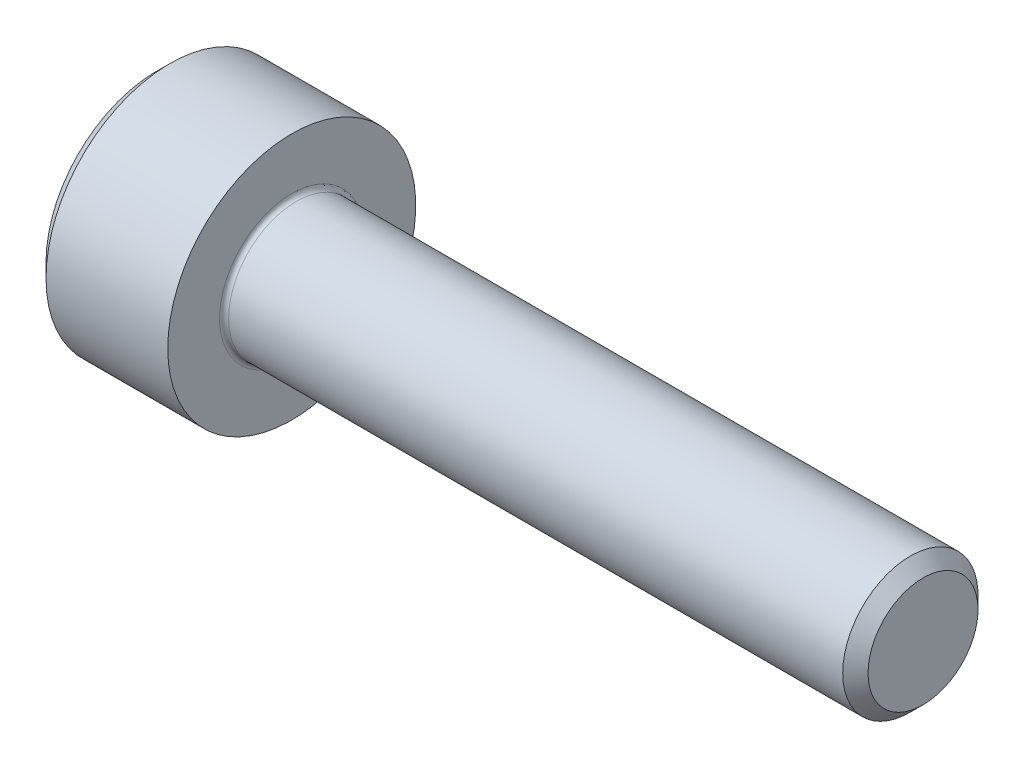
ISO-10303-21;
HEADER;
FILE_DESCRIPTION(('STEP AP214'),'2;1');
FILE_NAME('part.step','',(''),(''),'','','');
FILE_SCHEMA(('AUTOMOTIVE_DESIGN { 1 0 10303 214 1 1 1 1 }'));
ENDSEC;
DATA;
#1=APPLICATION_CONTEXT('core data for automotive mechanical design processes');
#2=APPLICATION_PROTOCOL_DEFINITION('international standard','automotive_design',2000,#1);
#3=PRODUCT_CONTEXT('',#1,'mechanical');
#4=PRODUCT('Part','Part','',(#3));
#5=PRODUCT_RELATED_PRODUCT_CATEGORY('part','',(#4));
#6=PRODUCT_DEFINITION_FORMATION('','',#4);
#7=PRODUCT_DEFINITION_CONTEXT('part definition',#1,'design');
#8=PRODUCT_DEFINITION('design','',#6,#7);
#9=PRODUCT_DEFINITION_SHAPE('','',#8);
#10=(LENGTH_UNIT() NAMED_UNIT(*) SI_UNIT(.MILLI.,.METRE.));
#11=(NAMED_UNIT(*) PLANE_ANGLE_UNIT() SI_UNIT($,.RADIAN.));
#12=(NAMED_UNIT(*) SI_UNIT($,.STERADIAN.) SOLID_ANGLE_UNIT());
#13=UNCERTAINTY_MEASURE_WITH_UNIT(LENGTH_MEASURE(1.E-05),#10,'distance_accuracy_value','');
#14=(GEOMETRIC_REPRESENTATION_CONTEXT(3) GLOBAL_UNCERTAINTY_ASSIGNED_CONTEXT((#13)) GLOBAL_UNIT_ASSIGNED_CONTEXT((#10,
#11,#12)) REPRESENTATION_CONTEXT('',''));
#15=CARTESIAN_POINT('',(0.,0.,0.));
#16=DIRECTION('',(0.,0.,1.));
#17=DIRECTION('',(1.,0.,0.));
#18=AXIS2_PLACEMENT_3D('',#15,#16,#17);
#19=CARTESIAN_POINT('',(0.,0.,0.));
#20=DIRECTION('',(-1.,0.,0.));
#21=DIRECTION('',(0.,0.,1.));
#22=AXIS2_PLACEMENT_3D('',#19,#20,#21);
#23=PLANE('',#22);
#24=DIRECTION('',(0.,-0.5,0.866025403784439));
#25=VECTOR('',#24,1.);
#26=CARTESIAN_POINT('',(0.,1.47801668912544,0.));
#27=LINE('',#26,#25);
#28=CARTESIAN_POINT('',(0.,1.47801668912544,0.));
#29=VERTEX_POINT('',#28);
#30=CARTESIAN_POINT('',(0.,0.739008344562719,1.28));
#31=VERTEX_POINT('',#30);
#32=EDGE_CURVE('E375',#29,#31,#27,.T.);
#33=ORIENTED_EDGE('',*,*,#32,.T.);
#34=DIRECTION('',(0.,1.,0.));
#35=VECTOR('',#34,1.);
#36=CARTESIAN_POINT('',(0.,-0.739008344562723,1.28));
#37=LINE('',#36,#35);
#38=CARTESIAN_POINT('',(0.,-0.739008344562723,1.28));
#39=VERTEX_POINT('',#38);
#40=EDGE_CURVE('E131',#39,#31,#37,.T.);
#41=ORIENTED_EDGE('',*,*,#40,.F.);
#42=DIRECTION('',(0.,-0.500000000000001,-0.866025403784438));
#43=VECTOR('',#42,1.);
#44=CARTESIAN_POINT('',(0.,-0.739008344562723,1.28));
#45=LINE('',#44,#43);
#46=CARTESIAN_POINT('',(0.,-1.47801668912545,0.));
#47=VERTEX_POINT('',#46);
#48=EDGE_CURVE('E378',#39,#47,#45,.T.);
#49=ORIENTED_EDGE('',*,*,#48,.T.);
#50=DIRECTION('',(0.,0.5,-0.866025403784439));
#51=VECTOR('',#50,1.);
#52=CARTESIAN_POINT('',(0.,-1.47801668912545,0.));
#53=LINE('',#52,#51);
#54=CARTESIAN_POINT('',(0.,-0.739008344562725,-1.28));
#55=VERTEX_POINT('',#54);
#56=EDGE_CURVE('E381',#47,#55,#53,.T.);
#57=ORIENTED_EDGE('',*,*,#56,.T.);
#58=DIRECTION('',(0.,-1.,0.));
#59=VECTOR('',#58,1.);
#60=CARTESIAN_POINT('',(0.,0.739008344562717,-1.28));
#61=LINE('',#60,#59);
#62=CARTESIAN_POINT('',(0.,0.739008344562717,-1.28));
#63=VERTEX_POINT('',#62);
#64=EDGE_CURVE('E384',#63,#55,#61,.T.);
#65=ORIENTED_EDGE('',*,*,#64,.F.);
#66=DIRECTION('',(0.,-0.500000000000001,-0.866025403784438));
#67=VECTOR('',#66,1.);
#68=CARTESIAN_POINT('',(0.,1.47801668912544,0.));
#69=LINE('',#68,#67);
#70=EDGE_CURVE('E126',#29,#63,#69,.T.);
#71=ORIENTED_EDGE('',*,*,#70,.F.);
#72=EDGE_LOOP('',(#33,#41,#49,#57,#65,#71));
#73=FACE_BOUND('',#72,.T.);
#74=CARTESIAN_POINT('',(0.,0.,0.));
#75=DIRECTION('',(-1.,0.,0.));
#76=DIRECTION('',(0.,0.,1.));
#77=AXIS2_PLACEMENT_3D('',#74,#75,#76);
#78=CIRCLE('',#77,2.45);
#79=CARTESIAN_POINT('',(0.,0.,2.45));
#80=VERTEX_POINT('',#79);
#81=EDGE_CURVE('E142',#80,#80,#78,.T.);
#82=ORIENTED_EDGE('',*,*,#81,.T.);
#83=EDGE_LOOP('',(#82));
#84=FACE_BOUND('',#83,.T.);
#85=ADVANCED_FACE('F35',(#73,#84),#23,.T.);
#86=CARTESIAN_POINT('',(17.,1.2195,0.));
#87=DIRECTION('',(1.,0.,0.));
#88=DIRECTION('',(0.,0.,-1.));
#89=AXIS2_PLACEMENT_3D('',#86,#87,#88);
#90=PLANE('',#89);
#91=CARTESIAN_POINT('',(17.,0.,0.));
#92=DIRECTION('',(-1.,0.,0.));
#93=DIRECTION('',(0.,0.,1.));
#94=AXIS2_PLACEMENT_3D('',#91,#92,#93);
#95=CIRCLE('',#94,1.2195);
#96=CARTESIAN_POINT('',(17.,0.,1.2195));
#97=VERTEX_POINT('',#96);
#98=EDGE_CURVE('E155',#97,#97,#95,.T.);
#99=ORIENTED_EDGE('',*,*,#98,.F.);
#100=EDGE_LOOP('',(#99));
#101=FACE_BOUND('',#100,.T.);
#102=ADVANCED_FACE('F176',(#101),#90,.T.);
#103=CARTESIAN_POINT('',(17.,0.,0.));
#104=DIRECTION('',(-1.,0.,0.));
#105=DIRECTION('',(0.,0.,1.));
#106=AXIS2_PLACEMENT_3D('',#103,#104,#105);
#107=CONICAL_SURFACE('',#106,1.2195,0.785398163397261);
#108=CARTESIAN_POINT('',(16.7195,0.,0.));
#109=DIRECTION('',(-1.,0.,0.));
#110=DIRECTION('',(0.,0.,1.));
#111=AXIS2_PLACEMENT_3D('',#108,#109,#110);
#112=CIRCLE('',#111,1.49999999999994);
#113=CARTESIAN_POINT('',(16.7195,0.,1.49999999999994));
#114=VERTEX_POINT('',#113);
#115=EDGE_CURVE('E152',#114,#114,#112,.T.);
#116=ORIENTED_EDGE('',*,*,#115,.F.);
#117=EDGE_LOOP('',(#116));
#118=FACE_BOUND('',#117,.T.);
#119=ORIENTED_EDGE('',*,*,#98,.T.);
#120=EDGE_LOOP('',(#119));
#121=FACE_BOUND('',#120,.T.);
#122=ADVANCED_FACE('F182',(#118,#121),#107,.T.);
#123=CARTESIAN_POINT('',(-31.75,0.,0.));
#124=DIRECTION('',(-1.,0.,0.));
#125=DIRECTION('',(0.,0.,1.));
#126=AXIS2_PLACEMENT_3D('',#123,#124,#125);
#127=CYLINDRICAL_SURFACE('',#126,1.49999999999997);
#128=CARTESIAN_POINT('',(3.1,0.,0.));
#129=DIRECTION('',(1.,0.,0.));
#130=DIRECTION('',(0.,0.,-1.));
#131=AXIS2_PLACEMENT_3D('',#128,#129,#130);
#132=CIRCLE('',#131,1.49999999999997);
#133=CARTESIAN_POINT('',(3.1,0.,-1.49999999999997));
#134=VERTEX_POINT('',#133);
#135=EDGE_CURVE('E11',#134,#134,#132,.T.);
#136=ORIENTED_EDGE('',*,*,#135,.T.);
#137=EDGE_LOOP('',(#136));
#138=FACE_BOUND('',#137,.T.);
#139=ORIENTED_EDGE('',*,*,#115,.T.);
#140=EDGE_LOOP('',(#139));
#141=FACE_BOUND('',#140,.T.);
#142=ADVANCED_FACE('F193',(#138,#141),#127,.T.);
#143=CARTESIAN_POINT('',(3.,2.75,0.));
#144=DIRECTION('',(1.,0.,0.));
#145=DIRECTION('',(0.,0.,-1.));
#146=AXIS2_PLACEMENT_3D('',#143,#144,#145);
#147=PLANE('',#146);
#148=CARTESIAN_POINT('',(3.,0.,0.));
#149=DIRECTION('',(1.,0.,0.));
#150=DIRECTION('',(0.,0.,-1.));
#151=AXIS2_PLACEMENT_3D('',#148,#149,#150);
#152=CIRCLE('',#151,1.59999999999997);
#153=CARTESIAN_POINT('',(3.,0.,-1.59999999999997));
#154=VERTEX_POINT('',#153);
#155=EDGE_CURVE('E43',#154,#154,#152,.F.);
#156=ORIENTED_EDGE('',*,*,#155,.T.);
#157=EDGE_LOOP('',(#156));
#158=FACE_BOUND('',#157,.T.);
#159=CARTESIAN_POINT('',(3.,0.,0.));
#160=DIRECTION('',(-1.,0.,0.));
#161=DIRECTION('',(0.,0.,1.));
#162=AXIS2_PLACEMENT_3D('',#159,#160,#161);
#163=CIRCLE('',#162,2.75);
#164=CARTESIAN_POINT('',(3.,0.,2.75));
#165=VERTEX_POINT('',#164);
#166=EDGE_CURVE('E149',#165,#165,#163,.T.);
#167=ORIENTED_EDGE('',*,*,#166,.F.);
#168=EDGE_LOOP('',(#167));
#169=FACE_BOUND('',#168,.T.);
#170=ADVANCED_FACE('F160',(#158,#169),#147,.T.);
#171=CARTESIAN_POINT('',(-31.75,0.,0.));
#172=DIRECTION('',(-1.,0.,0.));
#173=DIRECTION('',(0.,0.,1.));
#174=AXIS2_PLACEMENT_3D('',#171,#172,#173);
#175=CYLINDRICAL_SURFACE('',#174,2.75);
#176=ORIENTED_EDGE('',*,*,#166,.T.);
#177=EDGE_LOOP('',(#176));
#178=FACE_BOUND('',#177,.T.);
#179=CARTESIAN_POINT('',(0.300000000000002,0.,0.));
#180=DIRECTION('',(-1.,0.,0.));
#181=DIRECTION('',(0.,0.,1.));
#182=AXIS2_PLACEMENT_3D('',#179,#180,#181);
#183=CIRCLE('',#182,2.75);
#184=CARTESIAN_POINT('',(0.300000000000002,0.,2.75));
#185=VERTEX_POINT('',#184);
#186=EDGE_CURVE('E146',#185,#185,#183,.T.);
#187=ORIENTED_EDGE('',*,*,#186,.F.);
#188=EDGE_LOOP('',(#187));
#189=FACE_BOUND('',#188,.T.);
#190=ADVANCED_FACE('F171',(#178,#189),#175,.T.);
#191=CARTESIAN_POINT('',(0.,0.,0.));
#192=DIRECTION('',(1.,0.,0.));
#193=DIRECTION('',(0.,0.,-1.));
#194=AXIS2_PLACEMENT_3D('',#191,#192,#193);
#195=CONICAL_SURFACE('',#194,2.45,0.785398163397447);
#196=ORIENTED_EDGE('',*,*,#186,.T.);
#197=EDGE_LOOP('',(#196));
#198=FACE_BOUND('',#197,.T.);
#199=ORIENTED_EDGE('',*,*,#81,.F.);
#200=EDGE_LOOP('',(#199));
#201=FACE_BOUND('',#200,.T.);
#202=ADVANCED_FACE('F164',(#198,#201),#195,.T.);
#203=CARTESIAN_POINT('',(3.1,0.,0.));
#204=DIRECTION('',(1.,0.,0.));
#205=DIRECTION('',(0.,0.,-1.));
#206=AXIS2_PLACEMENT_3D('',#203,#204,#205);
#207=TOROIDAL_SURFACE('',#206,1.59999999999997,0.1);
#208=ORIENTED_EDGE('',*,*,#135,.F.);
#209=EDGE_LOOP('',(#208));
#210=FACE_BOUND('',#209,.T.);
#211=ORIENTED_EDGE('',*,*,#155,.F.);
#212=EDGE_LOOP('',(#211));
#213=FACE_BOUND('',#212,.T.);
#214=ADVANCED_FACE('F37',(#210,#213),#207,.F.);
#215=CARTESIAN_POINT('',(1.3,1.47801668912544,0.));
#216=DIRECTION('',(0.,-0.866025403784439,-0.5));
#217=DIRECTION('',(0.,0.5,-0.866025403784439));
#218=AXIS2_PLACEMENT_3D('',#215,#216,#217);
#219=PLANE('',#218);
#220=ORIENTED_EDGE('',*,*,#32,.F.);
#221=DIRECTION('',(-1.,0.,0.));
#222=VECTOR('',#221,1.);
#223=CARTESIAN_POINT('',(1.3,1.47801668912544,0.));
#224=LINE('',#223,#222);
#225=CARTESIAN_POINT('',(1.3,1.47801668912544,0.));
#226=VERTEX_POINT('',#225);
#227=EDGE_CURVE('E365',#226,#29,#224,.T.);
#228=ORIENTED_EDGE('',*,*,#227,.F.);
#229=DIRECTION('',(0.,-0.5,0.866025403784439));
#230=VECTOR('',#229,1.);
#231=CARTESIAN_POINT('',(1.3,1.47801668912544,0.));
#232=LINE('',#231,#230);
#233=CARTESIAN_POINT('',(1.3,1.10851251684408,0.639999999999998));
#234=VERTEX_POINT('',#233);
#235=EDGE_CURVE('E118',#226,#234,#232,.T.);
#236=ORIENTED_EDGE('',*,*,#235,.T.);
#237=CARTESIAN_POINT('',(1.3,0.739008344562719,1.28));
#238=VERTEX_POINT('',#237);
#239=EDGE_CURVE('E109',#234,#238,#232,.T.);
#240=ORIENTED_EDGE('',*,*,#239,.T.);
#241=DIRECTION('',(-1.,0.,0.));
#242=VECTOR('',#241,1.);
#243=CARTESIAN_POINT('',(1.3,0.739008344562719,1.28));
#244=LINE('',#243,#242);
#245=EDGE_CURVE('E123',#238,#31,#244,.T.);
#246=ORIENTED_EDGE('',*,*,#245,.T.);
#247=EDGE_LOOP('',(#220,#228,#236,#240,#246));
#248=FACE_BOUND('',#247,.T.);
#249=ADVANCED_FACE('F122',(#248),#219,.T.);
#250=CARTESIAN_POINT('',(1.3,-0.739008344562723,1.28));
#251=DIRECTION('',(0.,0.,1.));
#252=DIRECTION('',(0.,-1.,0.));
#253=AXIS2_PLACEMENT_3D('',#250,#251,#252);
#254=PLANE('',#253);
#255=ORIENTED_EDGE('',*,*,#40,.T.);
#256=ORIENTED_EDGE('',*,*,#245,.F.);
#257=DIRECTION('',(0.,1.,0.));
#258=VECTOR('',#257,1.);
#259=CARTESIAN_POINT('',(1.3,-0.739008344562723,1.28));
#260=LINE('',#259,#258);
#261=CARTESIAN_POINT('',(1.3,0.,1.28));
#262=VERTEX_POINT('',#261);
#263=EDGE_CURVE('E106',#262,#238,#260,.T.);
#264=ORIENTED_EDGE('',*,*,#263,.F.);
#265=CARTESIAN_POINT('',(1.3,-0.739008344562723,1.28));
#266=VERTEX_POINT('',#265);
#267=EDGE_CURVE('E117',#266,#262,#260,.T.);
#268=ORIENTED_EDGE('',*,*,#267,.F.);
#269=DIRECTION('',(-1.,0.,0.));
#270=VECTOR('',#269,1.);
#271=CARTESIAN_POINT('',(1.3,-0.739008344562723,1.28));
#272=LINE('',#271,#270);
#273=EDGE_CURVE('E133',#266,#39,#272,.T.);
#274=ORIENTED_EDGE('',*,*,#273,.T.);
#275=EDGE_LOOP('',(#255,#256,#264,#268,#274));
#276=FACE_BOUND('',#275,.T.);
#277=ADVANCED_FACE('F128',(#276),#254,.F.);
#278=CARTESIAN_POINT('',(1.3,-0.739008344562723,1.28));
#279=DIRECTION('',(0.,0.866025403784438,-0.500000000000001));
#280=DIRECTION('',(0.,0.500000000000001,0.866025403784438));
#281=AXIS2_PLACEMENT_3D('',#278,#279,#280);
#282=PLANE('',#281);
#283=ORIENTED_EDGE('',*,*,#48,.F.);
#284=ORIENTED_EDGE('',*,*,#273,.F.);
#285=DIRECTION('',(0.,-0.500000000000001,-0.866025403784438));
#286=VECTOR('',#285,1.);
#287=CARTESIAN_POINT('',(1.3,-0.739008344562723,1.28));
#288=LINE('',#287,#286);
#289=CARTESIAN_POINT('',(1.3,-1.10851251684408,0.640000000000003));
#290=VERTEX_POINT('',#289);
#291=EDGE_CURVE('E404',#266,#290,#288,.T.);
#292=ORIENTED_EDGE('',*,*,#291,.T.);
#293=CARTESIAN_POINT('',(1.3,-1.47801668912545,0.));
#294=VERTEX_POINT('',#293);
#295=EDGE_CURVE('E393',#290,#294,#288,.T.);
#296=ORIENTED_EDGE('',*,*,#295,.T.);
#297=DIRECTION('',(-1.,0.,0.));
#298=VECTOR('',#297,1.);
#299=CARTESIAN_POINT('',(1.3,-1.47801668912545,0.));
#300=LINE('',#299,#298);
#301=EDGE_CURVE('E138',#294,#47,#300,.T.);
#302=ORIENTED_EDGE('',*,*,#301,.T.);
#303=EDGE_LOOP('',(#283,#284,#292,#296,#302));
#304=FACE_BOUND('',#303,.T.);
#305=ADVANCED_FACE('F256',(#304),#282,.T.);
#306=CARTESIAN_POINT('',(1.3,-1.47801668912545,0.));
#307=DIRECTION('',(0.,0.866025403784439,0.5));
#308=DIRECTION('',(0.,-0.5,0.866025403784439));
#309=AXIS2_PLACEMENT_3D('',#306,#307,#308);
#310=PLANE('',#309);
#311=ORIENTED_EDGE('',*,*,#56,.F.);
#312=ORIENTED_EDGE('',*,*,#301,.F.);
#313=DIRECTION('',(0.,0.5,-0.866025403784439));
#314=VECTOR('',#313,1.);
#315=CARTESIAN_POINT('',(1.3,-1.47801668912545,0.));
#316=LINE('',#315,#314);
#317=CARTESIAN_POINT('',(1.3,-1.10851251684409,-0.640000000000002));
#318=VERTEX_POINT('',#317);
#319=EDGE_CURVE('E371',#294,#318,#316,.T.);
#320=ORIENTED_EDGE('',*,*,#319,.T.);
#321=CARTESIAN_POINT('',(1.3,-0.739008344562725,-1.28));
#322=VERTEX_POINT('',#321);
#323=EDGE_CURVE('E403',#318,#322,#316,.T.);
#324=ORIENTED_EDGE('',*,*,#323,.T.);
#325=DIRECTION('',(-1.,0.,0.));
#326=VECTOR('',#325,1.);
#327=CARTESIAN_POINT('',(1.3,-0.739008344562725,-1.28));
#328=LINE('',#327,#326);
#329=EDGE_CURVE('E364',#322,#55,#328,.T.);
#330=ORIENTED_EDGE('',*,*,#329,.T.);
#331=EDGE_LOOP('',(#311,#312,#320,#324,#330));
#332=FACE_BOUND('',#331,.T.);
#333=ADVANCED_FACE('F264',(#332),#310,.T.);
#334=CARTESIAN_POINT('',(1.3,0.739008344562717,-1.28));
#335=DIRECTION('',(0.,0.,-1.));
#336=DIRECTION('',(0.,1.,0.));
#337=AXIS2_PLACEMENT_3D('',#334,#335,#336);
#338=PLANE('',#337);
#339=ORIENTED_EDGE('',*,*,#64,.T.);
#340=ORIENTED_EDGE('',*,*,#329,.F.);
#341=DIRECTION('',(0.,-1.,0.));
#342=VECTOR('',#341,1.);
#343=CARTESIAN_POINT('',(1.3,0.739008344562717,-1.28));
#344=LINE('',#343,#342);
#345=CARTESIAN_POINT('',(1.3,0.,-1.28));
#346=VERTEX_POINT('',#345);
#347=EDGE_CURVE('E368',#346,#322,#344,.T.);
#348=ORIENTED_EDGE('',*,*,#347,.F.);
#349=CARTESIAN_POINT('',(1.3,0.739008344562717,-1.28));
#350=VERTEX_POINT('',#349);
#351=EDGE_CURVE('E50',#350,#346,#344,.T.);
#352=ORIENTED_EDGE('',*,*,#351,.F.);
#353=DIRECTION('',(-1.,0.,0.));
#354=VECTOR('',#353,1.);
#355=CARTESIAN_POINT('',(1.3,0.739008344562717,-1.28));
#356=LINE('',#355,#354);
#357=EDGE_CURVE('E361',#350,#63,#356,.T.);
#358=ORIENTED_EDGE('',*,*,#357,.T.);
#359=EDGE_LOOP('',(#339,#340,#348,#352,#358));
#360=FACE_BOUND('',#359,.T.);
#361=ADVANCED_FACE('F273',(#360),#338,.F.);
#362=CARTESIAN_POINT('',(1.3,1.47801668912544,0.));
#363=DIRECTION('',(0.,0.866025403784438,-0.500000000000001));
#364=DIRECTION('',(0.,0.500000000000001,0.866025403784438));
#365=AXIS2_PLACEMENT_3D('',#362,#363,#364);
#366=PLANE('',#365);
#367=ORIENTED_EDGE('',*,*,#70,.T.);
#368=ORIENTED_EDGE('',*,*,#357,.F.);
#369=DIRECTION('',(0.,-0.500000000000001,-0.866025403784438));
#370=VECTOR('',#369,1.);
#371=CARTESIAN_POINT('',(1.3,1.47801668912544,0.));
#372=LINE('',#371,#370);
#373=CARTESIAN_POINT('',(1.3,1.10851251684408,-0.640000000000001));
#374=VERTEX_POINT('',#373);
#375=EDGE_CURVE('E351',#374,#350,#372,.T.);
#376=ORIENTED_EDGE('',*,*,#375,.F.);
#377=EDGE_CURVE('E357',#226,#374,#372,.T.);
#378=ORIENTED_EDGE('',*,*,#377,.F.);
#379=ORIENTED_EDGE('',*,*,#227,.T.);
#380=EDGE_LOOP('',(#367,#368,#376,#378,#379));
#381=FACE_BOUND('',#380,.T.);
#382=ADVANCED_FACE('F282',(#381),#366,.F.);
#383=CARTESIAN_POINT('',(1.3,1.47801668912544,0.));
#384=DIRECTION('',(1.,0.,0.));
#385=DIRECTION('',(0.,0.,-1.));
#386=AXIS2_PLACEMENT_3D('',#383,#384,#385);
#387=PLANE('',#386);
#388=ORIENTED_EDGE('',*,*,#347,.T.);
#389=ORIENTED_EDGE('',*,*,#323,.F.);
#390=CARTESIAN_POINT('',(1.3,0.,0.));
#391=DIRECTION('',(-1.,0.,0.));
#392=DIRECTION('',(0.,0.,1.));
#393=AXIS2_PLACEMENT_3D('',#390,#391,#392);
#394=CIRCLE('',#393,1.28);
#395=EDGE_CURVE('E399',#346,#318,#394,.T.);
#396=ORIENTED_EDGE('',*,*,#395,.F.);
#397=EDGE_LOOP('',(#388,#389,#396));
#398=FACE_BOUND('',#397,.T.);
#399=ADVANCED_FACE('F291',(#398),#387,.F.);
#400=ORIENTED_EDGE('',*,*,#319,.F.);
#401=ORIENTED_EDGE('',*,*,#295,.F.);
#402=EDGE_CURVE('E136',#318,#290,#394,.T.);
#403=ORIENTED_EDGE('',*,*,#402,.F.);
#404=EDGE_LOOP('',(#400,#401,#403));
#405=FACE_BOUND('',#404,.T.);
#406=ADVANCED_FACE('F300',(#405),#387,.F.);
#407=ORIENTED_EDGE('',*,*,#291,.F.);
#408=ORIENTED_EDGE('',*,*,#267,.T.);
#409=EDGE_CURVE('E132',#290,#262,#394,.T.);
#410=ORIENTED_EDGE('',*,*,#409,.F.);
#411=EDGE_LOOP('',(#407,#408,#410));
#412=FACE_BOUND('',#411,.T.);
#413=ADVANCED_FACE('F309',(#412),#387,.F.);
#414=ORIENTED_EDGE('',*,*,#263,.T.);
#415=ORIENTED_EDGE('',*,*,#239,.F.);
#416=EDGE_CURVE('E112',#262,#234,#394,.T.);
#417=ORIENTED_EDGE('',*,*,#416,.F.);
#418=EDGE_LOOP('',(#414,#415,#417));
#419=FACE_BOUND('',#418,.T.);
#420=ADVANCED_FACE('F108',(#419),#387,.F.);
#421=ORIENTED_EDGE('',*,*,#235,.F.);
#422=ORIENTED_EDGE('',*,*,#377,.T.);
#423=EDGE_CURVE('E143',#234,#374,#394,.T.);
#424=ORIENTED_EDGE('',*,*,#423,.F.);
#425=EDGE_LOOP('',(#421,#422,#424));
#426=FACE_BOUND('',#425,.T.);
#427=ADVANCED_FACE('F324',(#426),#387,.F.);
#428=ORIENTED_EDGE('',*,*,#375,.T.);
#429=ORIENTED_EDGE('',*,*,#351,.T.);
#430=EDGE_CURVE('E354',#374,#346,#394,.T.);
#431=ORIENTED_EDGE('',*,*,#430,.F.);
#432=EDGE_LOOP('',(#428,#429,#431));
#433=FACE_BOUND('',#432,.T.);
#434=ADVANCED_FACE('F239',(#433),#387,.F.);
#435=CARTESIAN_POINT('',(1.3,0.,0.));
#436=DIRECTION('',(-1.,0.,0.));
#437=DIRECTION('',(0.,0.,1.));
#438=AXIS2_PLACEMENT_3D('',#435,#436,#437);
#439=CONICAL_SURFACE('',#438,1.28,1.0471975511966);
#440=CARTESIAN_POINT('',(2.03900834456273,0.,0.));
#441=VERTEX_POINT('',#440);
#442=VERTEX_LOOP('',#441);
#443=FACE_BOUND('',#442,.T.);
#444=ORIENTED_EDGE('',*,*,#416,.T.);
#445=ORIENTED_EDGE('',*,*,#423,.T.);
#446=ORIENTED_EDGE('',*,*,#430,.T.);
#447=ORIENTED_EDGE('',*,*,#395,.T.);
#448=ORIENTED_EDGE('',*,*,#402,.T.);
#449=ORIENTED_EDGE('',*,*,#409,.T.);
#450=EDGE_LOOP('',(#444,#445,#446,#447,#448,#449));
#451=FACE_BOUND('',#450,.T.);
#452=ADVANCED_FACE('F186',(#443,#451),#439,.F.);
#453=CLOSED_SHELL('',(#85,#102,#122,#142,#170,#190,#202,#214,#249,#277,#305,#333,#361,#382,#399,
#406,#413,#420,#427,#434,#452));
#454=MANIFOLD_SOLID_BREP('B2',#453);
#455=ADVANCED_BREP_SHAPE_REPRESENTATION('',(#18,#454),#14);
#456=SHAPE_DEFINITION_REPRESENTATION(#9,#455);
ENDSEC;
END-ISO-10303-21;
